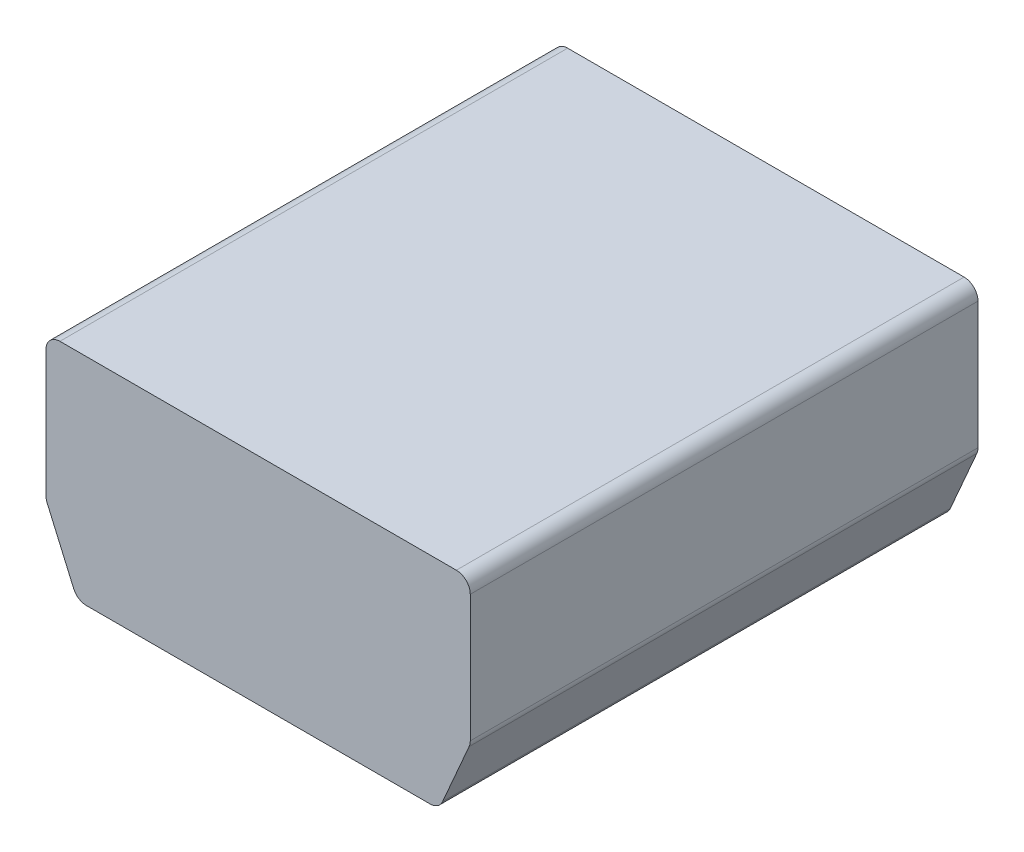
ISO-10303-21;
HEADER;
FILE_DESCRIPTION(('STEP AP214'),'2;1');
FILE_NAME('part.step','',(''),(''),'','','');
FILE_SCHEMA(('AUTOMOTIVE_DESIGN { 1 0 10303 214 1 1 1 1 }'));
ENDSEC;
DATA;
#1=APPLICATION_CONTEXT('core data for automotive mechanical design processes');
#2=APPLICATION_PROTOCOL_DEFINITION('international standard','automotive_design',2000,#1);
#3=PRODUCT_CONTEXT('',#1,'mechanical');
#4=PRODUCT('Part','Part','',(#3));
#5=PRODUCT_RELATED_PRODUCT_CATEGORY('part','',(#4));
#6=PRODUCT_DEFINITION_FORMATION('','',#4);
#7=PRODUCT_DEFINITION_CONTEXT('part definition',#1,'design');
#8=PRODUCT_DEFINITION('design','',#6,#7);
#9=PRODUCT_DEFINITION_SHAPE('','',#8);
#10=(LENGTH_UNIT() NAMED_UNIT(*) SI_UNIT(.MILLI.,.METRE.));
#11=(NAMED_UNIT(*) PLANE_ANGLE_UNIT() SI_UNIT($,.RADIAN.));
#12=(NAMED_UNIT(*) SI_UNIT($,.STERADIAN.) SOLID_ANGLE_UNIT());
#13=UNCERTAINTY_MEASURE_WITH_UNIT(LENGTH_MEASURE(1.E-05),#10,'distance_accuracy_value','');
#14=(GEOMETRIC_REPRESENTATION_CONTEXT(3) GLOBAL_UNCERTAINTY_ASSIGNED_CONTEXT((#13)) GLOBAL_UNIT_ASSIGNED_CONTEXT((#10,
#11,#12)) REPRESENTATION_CONTEXT('',''));
#15=CARTESIAN_POINT('',(0.,0.,0.));
#16=DIRECTION('',(0.,0.,1.));
#17=DIRECTION('',(1.,0.,0.));
#18=AXIS2_PLACEMENT_3D('',#15,#16,#17);
#19=CARTESIAN_POINT('',(-3.3684488384,0.1525862328,0.));
#20=DIRECTION('',(0.916834796588267,0.399266772678306,0.));
#21=DIRECTION('',(-0.399266772678306,0.916834796588267,0.));
#22=AXIS2_PLACEMENT_3D('',#19,#20,#21);
#23=PLANE('',#22);
#24=DIRECTION('',(-0.399266772678306,0.916834796588267,0.));
#25=VECTOR('',#24,1.);
#26=CARTESIAN_POINT('',(-3.6104124388,0.7082063433,0.));
#27=LINE('',#26,#25);
#28=CARTESIAN_POINT('',(-3.36844883946309,0.152586239705988,0.));
#29=VERTEX_POINT('',#28);
#30=CARTESIAN_POINT('',(-3.85237604026309,1.26382646070599,0.));
#31=VERTEX_POINT('',#30);
#32=EDGE_CURVE('E187',#29,#31,#27,.T.);
#33=ORIENTED_EDGE('',*,*,#32,.F.);
#34=DIRECTION('',(0.,0.,-1.));
#35=VECTOR('',#34,1.);
#36=CARTESIAN_POINT('',(-3.36844883812397,0.152586241095773,4.6355));
#37=LINE('',#36,#35);
#38=CARTESIAN_POINT('',(-3.36844883946309,0.152586239705988,9.271));
#39=VERTEX_POINT('',#38);
#40=EDGE_CURVE('E202',#29,#39,#37,.F.);
#41=ORIENTED_EDGE('',*,*,#40,.T.);
#42=DIRECTION('',(0.399266772678306,-0.916834796588267,0.));
#43=VECTOR('',#42,1.);
#44=CARTESIAN_POINT('',(-3.6104124388,0.7082063433,9.271));
#45=LINE('',#44,#43);
#46=CARTESIAN_POINT('',(-3.85237604026309,1.26382646070599,9.271));
#47=VERTEX_POINT('',#46);
#48=EDGE_CURVE('E204',#47,#39,#45,.T.);
#49=ORIENTED_EDGE('',*,*,#48,.F.);
#50=DIRECTION('',(0.,0.,1.));
#51=VECTOR('',#50,1.);
#52=CARTESIAN_POINT('',(-3.85237603892397,1.26382646209577,4.6355));
#53=LINE('',#52,#51);
#54=EDGE_CURVE('E284',#47,#31,#53,.F.);
#55=ORIENTED_EDGE('',*,*,#54,.T.);
#56=EDGE_LOOP('',(#33,#41,#49,#55));
#57=FACE_BOUND('',#56,.T.);
#58=ADVANCED_FACE('F16',(#57),#23,.F.);
#59=CARTESIAN_POINT('',(3.8523760392,1.2638264538,0.));
#60=DIRECTION('',(-0.916834796588267,0.399266772678306,0.));
#61=DIRECTION('',(-0.399266772678306,-0.916834796588267,0.));
#62=AXIS2_PLACEMENT_3D('',#59,#60,#61);
#63=PLANE('',#62);
#64=DIRECTION('',(-0.399266772678306,-0.916834796588267,0.));
#65=VECTOR('',#64,1.);
#66=CARTESIAN_POINT('',(3.6104124388,0.7082063433,0.));
#67=LINE('',#66,#65);
#68=CARTESIAN_POINT('',(3.8523760402514,1.26382646067913,0.));
#69=VERTEX_POINT('',#68);
#70=CARTESIAN_POINT('',(3.3684488394514,0.152586239679135,0.));
#71=VERTEX_POINT('',#70);
#72=EDGE_CURVE('E175',#69,#71,#67,.T.);
#73=ORIENTED_EDGE('',*,*,#72,.F.);
#74=DIRECTION('',(0.,0.,-1.));
#75=VECTOR('',#74,1.);
#76=CARTESIAN_POINT('',(3.85237603890058,1.26382646204207,4.6355));
#77=LINE('',#76,#75);
#78=CARTESIAN_POINT('',(3.8523760402514,1.26382646067913,9.271));
#79=VERTEX_POINT('',#78);
#80=EDGE_CURVE('E262',#69,#79,#77,.F.);
#81=ORIENTED_EDGE('',*,*,#80,.T.);
#82=DIRECTION('',(-0.399266772678306,-0.916834796588267,0.));
#83=VECTOR('',#82,1.);
#84=CARTESIAN_POINT('',(3.8523760392,1.2638264538,9.271));
#85=LINE('',#84,#83);
#86=CARTESIAN_POINT('',(3.3684488394514,0.152586239679135,9.271));
#87=VERTEX_POINT('',#86);
#88=EDGE_CURVE('E198',#79,#87,#85,.T.);
#89=ORIENTED_EDGE('',*,*,#88,.T.);
#90=DIRECTION('',(0.,0.,1.));
#91=VECTOR('',#90,1.);
#92=CARTESIAN_POINT('',(3.36844883810058,0.152586241042068,4.6355));
#93=LINE('',#92,#91);
#94=EDGE_CURVE('E186',#87,#71,#93,.F.);
#95=ORIENTED_EDGE('',*,*,#94,.T.);
#96=EDGE_LOOP('',(#73,#81,#89,#95));
#97=FACE_BOUND('',#96,.T.);
#98=ADVANCED_FACE('F197',(#97),#63,.F.);
#99=CARTESIAN_POINT('',(3.1355727992,0.254,9.271));
#100=DIRECTION('',(0.,0.,-1.));
#101=DIRECTION('',(-1.,0.,0.));
#102=AXIS2_PLACEMENT_3D('',#99,#100,#101);
#103=CYLINDRICAL_SURFACE('',#102,0.254);
#104=CARTESIAN_POINT('',(3.1355727992,0.254,0.));
#105=DIRECTION('',(0.,0.,-1.));
#106=DIRECTION('',(-1.,0.,0.));
#107=AXIS2_PLACEMENT_3D('',#104,#105,#106);
#108=CIRCLE('',#107,0.254);
#109=CARTESIAN_POINT('',(3.1355727992,0.,0.));
#110=VERTEX_POINT('',#109);
#111=EDGE_CURVE('E20',#71,#110,#108,.T.);
#112=ORIENTED_EDGE('',*,*,#111,.F.);
#113=ORIENTED_EDGE('',*,*,#94,.F.);
#114=CARTESIAN_POINT('',(3.1355727992,0.254,9.271));
#115=DIRECTION('',(0.,0.,-1.));
#116=DIRECTION('',(-1.,0.,0.));
#117=AXIS2_PLACEMENT_3D('',#114,#115,#116);
#118=CIRCLE('',#117,0.254);
#119=CARTESIAN_POINT('',(3.1355727992,0.,9.271));
#120=VERTEX_POINT('',#119);
#121=EDGE_CURVE('E278',#87,#120,#118,.T.);
#122=ORIENTED_EDGE('',*,*,#121,.T.);
#123=DIRECTION('',(0.,0.,-1.));
#124=VECTOR('',#123,1.);
#125=CARTESIAN_POINT('',(3.1355727992,0.,4.6355));
#126=LINE('',#125,#124);
#127=EDGE_CURVE('E193',#120,#110,#126,.T.);
#128=ORIENTED_EDGE('',*,*,#127,.T.);
#129=EDGE_LOOP('',(#112,#113,#122,#128));
#130=FACE_BOUND('',#129,.T.);
#131=ADVANCED_FACE('F190',(#130),#103,.T.);
#132=CARTESIAN_POINT('',(-3.1355727992,0.254,9.271));
#133=DIRECTION('',(0.,0.,-1.));
#134=DIRECTION('',(-1.,0.,0.));
#135=AXIS2_PLACEMENT_3D('',#132,#133,#134);
#136=CYLINDRICAL_SURFACE('',#135,0.254000000000001);
#137=CARTESIAN_POINT('',(-3.1355727992,0.254,0.));
#138=DIRECTION('',(0.,0.,-1.));
#139=DIRECTION('',(-1.,0.,0.));
#140=AXIS2_PLACEMENT_3D('',#137,#138,#139);
#141=CIRCLE('',#140,0.254000000000001);
#142=CARTESIAN_POINT('',(-3.1355727992,0.,0.));
#143=VERTEX_POINT('',#142);
#144=EDGE_CURVE('E195',#143,#29,#141,.T.);
#145=ORIENTED_EDGE('',*,*,#144,.F.);
#146=DIRECTION('',(0.,0.,1.));
#147=VECTOR('',#146,1.);
#148=CARTESIAN_POINT('',(-3.1355727992,0.,4.6355));
#149=LINE('',#148,#147);
#150=CARTESIAN_POINT('',(-3.1355727992,0.,9.271));
#151=VERTEX_POINT('',#150);
#152=EDGE_CURVE('E300',#143,#151,#149,.T.);
#153=ORIENTED_EDGE('',*,*,#152,.T.);
#154=CARTESIAN_POINT('',(-3.1355727992,0.254,9.271));
#155=DIRECTION('',(0.,0.,-1.));
#156=DIRECTION('',(-1.,0.,0.));
#157=AXIS2_PLACEMENT_3D('',#154,#155,#156);
#158=CIRCLE('',#157,0.254000000000001);
#159=EDGE_CURVE('E275',#151,#39,#158,.T.);
#160=ORIENTED_EDGE('',*,*,#159,.T.);
#161=ORIENTED_EDGE('',*,*,#40,.F.);
#162=EDGE_LOOP('',(#145,#153,#160,#161));
#163=FACE_BOUND('',#162,.T.);
#164=ADVANCED_FACE('F613',(#163),#136,.T.);
#165=CARTESIAN_POINT('',(-3.6195,1.365240221,9.271));
#166=DIRECTION('',(0.,0.,-1.));
#167=DIRECTION('',(-1.,0.,0.));
#168=AXIS2_PLACEMENT_3D('',#165,#166,#167);
#169=CYLINDRICAL_SURFACE('',#168,0.254);
#170=CARTESIAN_POINT('',(-3.6195,1.365240221,0.));
#171=DIRECTION('',(0.,0.,-1.));
#172=DIRECTION('',(-1.,0.,0.));
#173=AXIS2_PLACEMENT_3D('',#170,#171,#172);
#174=CIRCLE('',#173,0.254);
#175=CARTESIAN_POINT('',(-3.8735,1.365240221,0.));
#176=VERTEX_POINT('',#175);
#177=EDGE_CURVE('E283',#31,#176,#174,.T.);
#178=ORIENTED_EDGE('',*,*,#177,.F.);
#179=ORIENTED_EDGE('',*,*,#54,.F.);
#180=CARTESIAN_POINT('',(-3.6195,1.365240221,9.271));
#181=DIRECTION('',(0.,0.,-1.));
#182=DIRECTION('',(-1.,0.,0.));
#183=AXIS2_PLACEMENT_3D('',#180,#181,#182);
#184=CIRCLE('',#183,0.254);
#185=CARTESIAN_POINT('',(-3.8735,1.365240221,9.271));
#186=VERTEX_POINT('',#185);
#187=EDGE_CURVE('E273',#47,#186,#184,.T.);
#188=ORIENTED_EDGE('',*,*,#187,.T.);
#189=DIRECTION('',(0.,0.,-1.));
#190=VECTOR('',#189,1.);
#191=CARTESIAN_POINT('',(-3.8735,1.365240221,4.6355));
#192=LINE('',#191,#190);
#193=EDGE_CURVE('E299',#186,#176,#192,.T.);
#194=ORIENTED_EDGE('',*,*,#193,.T.);
#195=EDGE_LOOP('',(#178,#179,#188,#194));
#196=FACE_BOUND('',#195,.T.);
#197=ADVANCED_FACE('F604',(#196),#169,.T.);
#198=CARTESIAN_POINT('',(-3.6195,3.683,9.271));
#199=DIRECTION('',(0.,0.,-1.));
#200=DIRECTION('',(-1.,0.,0.));
#201=AXIS2_PLACEMENT_3D('',#198,#199,#200);
#202=CYLINDRICAL_SURFACE('',#201,0.254);
#203=CARTESIAN_POINT('',(-3.6195,3.683,0.));
#204=DIRECTION('',(0.,0.,-1.));
#205=DIRECTION('',(-1.,0.,0.));
#206=AXIS2_PLACEMENT_3D('',#203,#204,#205);
#207=CIRCLE('',#206,0.254);
#208=CARTESIAN_POINT('',(-3.8735,3.683,0.));
#209=VERTEX_POINT('',#208);
#210=CARTESIAN_POINT('',(-3.6195,3.937,0.));
#211=VERTEX_POINT('',#210);
#212=EDGE_CURVE('E281',#209,#211,#207,.T.);
#213=ORIENTED_EDGE('',*,*,#212,.F.);
#214=DIRECTION('',(0.,0.,1.));
#215=VECTOR('',#214,1.);
#216=CARTESIAN_POINT('',(-3.8735,3.683,4.6355));
#217=LINE('',#216,#215);
#218=CARTESIAN_POINT('',(-3.8735,3.683,9.271));
#219=VERTEX_POINT('',#218);
#220=EDGE_CURVE('E305',#209,#219,#217,.T.);
#221=ORIENTED_EDGE('',*,*,#220,.T.);
#222=CARTESIAN_POINT('',(-3.6195,3.683,9.271));
#223=DIRECTION('',(0.,0.,-1.));
#224=DIRECTION('',(-1.,0.,0.));
#225=AXIS2_PLACEMENT_3D('',#222,#223,#224);
#226=CIRCLE('',#225,0.254);
#227=CARTESIAN_POINT('',(-3.6195,3.937,9.271));
#228=VERTEX_POINT('',#227);
#229=EDGE_CURVE('E271',#219,#228,#226,.T.);
#230=ORIENTED_EDGE('',*,*,#229,.T.);
#231=DIRECTION('',(0.,0.,-1.));
#232=VECTOR('',#231,1.);
#233=CARTESIAN_POINT('',(-3.6195,3.937,4.6355));
#234=LINE('',#233,#232);
#235=EDGE_CURVE('E304',#228,#211,#234,.T.);
#236=ORIENTED_EDGE('',*,*,#235,.T.);
#237=EDGE_LOOP('',(#213,#221,#230,#236));
#238=FACE_BOUND('',#237,.T.);
#239=ADVANCED_FACE('F595',(#238),#202,.T.);
#240=CARTESIAN_POINT('',(3.8735,0.,9.271));
#241=DIRECTION('',(0.,0.,-1.));
#242=DIRECTION('',(-1.,0.,0.));
#243=AXIS2_PLACEMENT_3D('',#240,#241,#242);
#244=PLANE('',#243);
#245=DIRECTION('',(0.,1.,0.));
#246=VECTOR('',#245,1.);
#247=CARTESIAN_POINT('',(3.8735,2.5241201105,9.271));
#248=LINE('',#247,#246);
#249=CARTESIAN_POINT('',(3.8735,1.365240221,9.271));
#250=VERTEX_POINT('',#249);
#251=CARTESIAN_POINT('',(3.8735,3.683,9.271));
#252=VERTEX_POINT('',#251);
#253=EDGE_CURVE('E306',#250,#252,#248,.T.);
#254=ORIENTED_EDGE('',*,*,#253,.T.);
#255=CARTESIAN_POINT('',(3.6195,3.683,9.271));
#256=DIRECTION('',(0.,0.,-1.));
#257=DIRECTION('',(-1.,0.,0.));
#258=AXIS2_PLACEMENT_3D('',#255,#256,#257);
#259=CIRCLE('',#258,0.254);
#260=CARTESIAN_POINT('',(3.6195,3.937,9.271));
#261=VERTEX_POINT('',#260);
#262=EDGE_CURVE('E268',#252,#261,#259,.F.);
#263=ORIENTED_EDGE('',*,*,#262,.T.);
#264=DIRECTION('',(-1.,0.,0.));
#265=VECTOR('',#264,1.);
#266=CARTESIAN_POINT('',(0.,3.937,9.271));
#267=LINE('',#266,#265);
#268=EDGE_CURVE('E301',#261,#228,#267,.T.);
#269=ORIENTED_EDGE('',*,*,#268,.T.);
#270=ORIENTED_EDGE('',*,*,#229,.F.);
#271=DIRECTION('',(0.,-1.,0.));
#272=VECTOR('',#271,1.);
#273=CARTESIAN_POINT('',(-3.8735,2.5241201105,9.271));
#274=LINE('',#273,#272);
#275=EDGE_CURVE('E296',#219,#186,#274,.T.);
#276=ORIENTED_EDGE('',*,*,#275,.T.);
#277=ORIENTED_EDGE('',*,*,#187,.F.);
#278=ORIENTED_EDGE('',*,*,#48,.T.);
#279=ORIENTED_EDGE('',*,*,#159,.F.);
#280=DIRECTION('',(1.,0.,0.));
#281=VECTOR('',#280,1.);
#282=CARTESIAN_POINT('',(0.,0.,9.271));
#283=LINE('',#282,#281);
#284=EDGE_CURVE('E293',#151,#120,#283,.T.);
#285=ORIENTED_EDGE('',*,*,#284,.T.);
#286=ORIENTED_EDGE('',*,*,#121,.F.);
#287=ORIENTED_EDGE('',*,*,#88,.F.);
#288=CARTESIAN_POINT('',(3.6195,1.365240221,9.271));
#289=DIRECTION('',(0.,0.,-1.));
#290=DIRECTION('',(-1.,0.,0.));
#291=AXIS2_PLACEMENT_3D('',#288,#289,#290);
#292=CIRCLE('',#291,0.254);
#293=EDGE_CURVE('E263',#79,#250,#292,.F.);
#294=ORIENTED_EDGE('',*,*,#293,.T.);
#295=EDGE_LOOP('',(#254,#263,#269,#270,#276,#277,#278,#279,#285,#286,#287,#294));
#296=FACE_BOUND('',#295,.T.);
#297=ADVANCED_FACE('F586',(#296),#244,.F.);
#298=CARTESIAN_POINT('',(3.6195,3.683,9.271));
#299=DIRECTION('',(0.,0.,-1.));
#300=DIRECTION('',(-1.,0.,0.));
#301=AXIS2_PLACEMENT_3D('',#298,#299,#300);
#302=CYLINDRICAL_SURFACE('',#301,0.254);
#303=CARTESIAN_POINT('',(3.6195,3.683,0.));
#304=DIRECTION('',(0.,0.,-1.));
#305=DIRECTION('',(-1.,0.,0.));
#306=AXIS2_PLACEMENT_3D('',#303,#304,#305);
#307=CIRCLE('',#306,0.254);
#308=CARTESIAN_POINT('',(3.6195,3.937,0.));
#309=VERTEX_POINT('',#308);
#310=CARTESIAN_POINT('',(3.8735,3.683,0.));
#311=VERTEX_POINT('',#310);
#312=EDGE_CURVE('E266',#309,#311,#307,.T.);
#313=ORIENTED_EDGE('',*,*,#312,.F.);
#314=DIRECTION('',(0.,0.,1.));
#315=VECTOR('',#314,1.);
#316=CARTESIAN_POINT('',(3.6195,3.937,4.6355));
#317=LINE('',#316,#315);
#318=EDGE_CURVE('E310',#309,#261,#317,.T.);
#319=ORIENTED_EDGE('',*,*,#318,.T.);
#320=ORIENTED_EDGE('',*,*,#262,.F.);
#321=DIRECTION('',(0.,0.,-1.));
#322=VECTOR('',#321,1.);
#323=CARTESIAN_POINT('',(3.8735,3.683,4.6355));
#324=LINE('',#323,#322);
#325=EDGE_CURVE('E309',#252,#311,#324,.T.);
#326=ORIENTED_EDGE('',*,*,#325,.T.);
#327=EDGE_LOOP('',(#313,#319,#320,#326));
#328=FACE_BOUND('',#327,.T.);
#329=ADVANCED_FACE('F577',(#328),#302,.T.);
#330=CARTESIAN_POINT('',(3.6195,1.365240221,9.271));
#331=DIRECTION('',(0.,0.,-1.));
#332=DIRECTION('',(-1.,0.,0.));
#333=AXIS2_PLACEMENT_3D('',#330,#331,#332);
#334=CYLINDRICAL_SURFACE('',#333,0.254);
#335=CARTESIAN_POINT('',(3.6195,1.365240221,0.));
#336=DIRECTION('',(0.,0.,-1.));
#337=DIRECTION('',(-1.,0.,0.));
#338=AXIS2_PLACEMENT_3D('',#335,#336,#337);
#339=CIRCLE('',#338,0.254);
#340=CARTESIAN_POINT('',(3.8735,1.365240221,0.));
#341=VERTEX_POINT('',#340);
#342=EDGE_CURVE('E181',#341,#69,#339,.T.);
#343=ORIENTED_EDGE('',*,*,#342,.F.);
#344=DIRECTION('',(0.,0.,1.));
#345=VECTOR('',#344,1.);
#346=CARTESIAN_POINT('',(3.8735,1.365240221,4.6355));
#347=LINE('',#346,#345);
#348=EDGE_CURVE('E322',#341,#250,#347,.T.);
#349=ORIENTED_EDGE('',*,*,#348,.T.);
#350=ORIENTED_EDGE('',*,*,#293,.F.);
#351=ORIENTED_EDGE('',*,*,#80,.F.);
#352=EDGE_LOOP('',(#343,#349,#350,#351));
#353=FACE_BOUND('',#352,.T.);
#354=ADVANCED_FACE('F568',(#353),#334,.T.);
#355=CARTESIAN_POINT('',(-3.1355727992,0.,0.));
#356=DIRECTION('',(0.,1.,0.));
#357=DIRECTION('',(0.,0.,1.));
#358=AXIS2_PLACEMENT_3D('',#355,#356,#357);
#359=PLANE('',#358);
#360=DIRECTION('',(-1.,0.,0.));
#361=VECTOR('',#360,1.);
#362=CARTESIAN_POINT('',(0.,0.,0.));
#363=LINE('',#362,#361);
#364=EDGE_CURVE('E331',#110,#143,#363,.T.);
#365=ORIENTED_EDGE('',*,*,#364,.F.);
#366=ORIENTED_EDGE('',*,*,#127,.F.);
#367=ORIENTED_EDGE('',*,*,#284,.F.);
#368=ORIENTED_EDGE('',*,*,#152,.F.);
#369=EDGE_LOOP('',(#365,#366,#367,#368));
#370=FACE_BOUND('',#369,.T.);
#371=ADVANCED_FACE('F559',(#370),#359,.F.);
#372=CARTESIAN_POINT('',(-3.8735,1.365240221,0.));
#373=DIRECTION('',(1.,0.,0.));
#374=DIRECTION('',(0.,1.,0.));
#375=AXIS2_PLACEMENT_3D('',#372,#373,#374);
#376=PLANE('',#375);
#377=DIRECTION('',(0.,1.,0.));
#378=VECTOR('',#377,1.);
#379=CARTESIAN_POINT('',(-3.8735,1.9685,0.));
#380=LINE('',#379,#378);
#381=EDGE_CURVE('E333',#176,#209,#380,.T.);
#382=ORIENTED_EDGE('',*,*,#381,.F.);
#383=ORIENTED_EDGE('',*,*,#193,.F.);
#384=ORIENTED_EDGE('',*,*,#275,.F.);
#385=ORIENTED_EDGE('',*,*,#220,.F.);
#386=EDGE_LOOP('',(#382,#383,#384,#385));
#387=FACE_BOUND('',#386,.T.);
#388=ADVANCED_FACE('F550',(#387),#376,.F.);
#389=CARTESIAN_POINT('',(-3.6195,3.937,9.271));
#390=DIRECTION('',(0.,-1.,0.));
#391=DIRECTION('',(0.,0.,-1.));
#392=AXIS2_PLACEMENT_3D('',#389,#390,#391);
#393=PLANE('',#392);
#394=DIRECTION('',(1.,0.,0.));
#395=VECTOR('',#394,1.);
#396=CARTESIAN_POINT('',(0.,3.937,0.));
#397=LINE('',#396,#395);
#398=EDGE_CURVE('E336',#211,#309,#397,.T.);
#399=ORIENTED_EDGE('',*,*,#398,.F.);
#400=ORIENTED_EDGE('',*,*,#235,.F.);
#401=ORIENTED_EDGE('',*,*,#268,.F.);
#402=ORIENTED_EDGE('',*,*,#318,.F.);
#403=EDGE_LOOP('',(#399,#400,#401,#402));
#404=FACE_BOUND('',#403,.T.);
#405=ADVANCED_FACE('F542',(#404),#393,.F.);
#406=CARTESIAN_POINT('',(3.8735,3.683,0.));
#407=DIRECTION('',(-1.,0.,0.));
#408=DIRECTION('',(0.,-1.,0.));
#409=AXIS2_PLACEMENT_3D('',#406,#407,#408);
#410=PLANE('',#409);
#411=DIRECTION('',(0.,-1.,0.));
#412=VECTOR('',#411,1.);
#413=CARTESIAN_POINT('',(3.8735,1.9685,0.));
#414=LINE('',#413,#412);
#415=EDGE_CURVE('E260',#311,#341,#414,.T.);
#416=ORIENTED_EDGE('',*,*,#415,.F.);
#417=ORIENTED_EDGE('',*,*,#325,.F.);
#418=ORIENTED_EDGE('',*,*,#253,.F.);
#419=ORIENTED_EDGE('',*,*,#348,.F.);
#420=EDGE_LOOP('',(#416,#417,#418,#419));
#421=FACE_BOUND('',#420,.T.);
#422=ADVANCED_FACE('F452',(#421),#410,.F.);
#423=CARTESIAN_POINT('',(3.4925,1.3916936606,0.));
#424=DIRECTION('',(-0.916834802884332,0.399266758220676,0.));
#425=DIRECTION('',(-0.399266758220676,-0.916834802884332,0.));
#426=AXIS2_PLACEMENT_3D('',#423,#424,#425);
#427=PLANE('',#426);
#428=DIRECTION('',(0.,0.,1.));
#429=VECTOR('',#428,1.);
#430=CARTESIAN_POINT('',(3.4925,1.3916936606,4.445));
#431=LINE('',#430,#429);
#432=CARTESIAN_POINT('',(3.4925,1.39169366221102,0.));
#433=VERTEX_POINT('',#432);
#434=CARTESIAN_POINT('',(3.4925,1.3916936606,8.89));
#435=VERTEX_POINT('',#434);
#436=EDGE_CURVE('E213',#433,#435,#431,.T.);
#437=ORIENTED_EDGE('',*,*,#436,.F.);
#438=DIRECTION('',(0.399266765488405,0.916834799719353,0.));
#439=VECTOR('',#438,1.);
#440=CARTESIAN_POINT('',(3.05235921404,0.381000001778,0.));
#441=LINE('',#440,#439);
#442=CARTESIAN_POINT('',(3.05235921873286,0.381,0.));
#443=VERTEX_POINT('',#442);
#444=EDGE_CURVE('E255',#443,#433,#441,.T.);
#445=ORIENTED_EDGE('',*,*,#444,.F.);
#446=DIRECTION('',(0.,0.,-1.));
#447=VECTOR('',#446,1.);
#448=CARTESIAN_POINT('',(3.0523592242,0.381,4.445));
#449=LINE('',#448,#447);
#450=CARTESIAN_POINT('',(3.0523592207075,0.381,8.89));
#451=VERTEX_POINT('',#450);
#452=EDGE_CURVE('E207',#451,#443,#449,.T.);
#453=ORIENTED_EDGE('',*,*,#452,.F.);
#454=DIRECTION('',(0.399266758220676,0.916834802884332,0.));
#455=VECTOR('',#454,1.);
#456=CARTESIAN_POINT('',(3.2724296121,0.8863468303,8.89));
#457=LINE('',#456,#455);
#458=EDGE_CURVE('E325',#451,#435,#457,.T.);
#459=ORIENTED_EDGE('',*,*,#458,.T.);
#460=EDGE_LOOP('',(#437,#445,#453,#459));
#461=FACE_BOUND('',#460,.T.);
#462=ADVANCED_FACE('F435',(#461),#427,.T.);
#463=CARTESIAN_POINT('',(-3.0523592242,0.381,0.));
#464=DIRECTION('',(0.916834802884332,0.399266758220676,0.));
#465=DIRECTION('',(-0.399266758220676,0.916834802884332,0.));
#466=AXIS2_PLACEMENT_3D('',#463,#464,#465);
#467=PLANE('',#466);
#468=DIRECTION('',(0.,0.,1.));
#469=VECTOR('',#468,1.);
#470=CARTESIAN_POINT('',(-3.0523592242,0.381,4.445));
#471=LINE('',#470,#469);
#472=CARTESIAN_POINT('',(-3.05235921873286,0.381,0.));
#473=VERTEX_POINT('',#472);
#474=CARTESIAN_POINT('',(-3.0523592207075,0.381,8.89));
#475=VERTEX_POINT('',#474);
#476=EDGE_CURVE('E210',#473,#475,#471,.T.);
#477=ORIENTED_EDGE('',*,*,#476,.F.);
#478=DIRECTION('',(0.399266765488405,-0.916834799719353,0.));
#479=VECTOR('',#478,1.);
#480=CARTESIAN_POINT('',(-3.492499998984,1.391693661489,0.));
#481=LINE('',#480,#479);
#482=CARTESIAN_POINT('',(-3.4925,1.39169366221102,0.));
#483=VERTEX_POINT('',#482);
#484=EDGE_CURVE('E258',#483,#473,#481,.T.);
#485=ORIENTED_EDGE('',*,*,#484,.F.);
#486=DIRECTION('',(0.,0.,-1.));
#487=VECTOR('',#486,1.);
#488=CARTESIAN_POINT('',(-3.4925,1.3916936606,4.445));
#489=LINE('',#488,#487);
#490=CARTESIAN_POINT('',(-3.4925,1.3916936606,8.89));
#491=VERTEX_POINT('',#490);
#492=EDGE_CURVE('E220',#491,#483,#489,.T.);
#493=ORIENTED_EDGE('',*,*,#492,.F.);
#494=DIRECTION('',(0.399266758220676,-0.916834802884332,0.));
#495=VECTOR('',#494,1.);
#496=CARTESIAN_POINT('',(-3.2724296121,0.8863468303,8.89));
#497=LINE('',#496,#495);
#498=EDGE_CURVE('E329',#491,#475,#497,.T.);
#499=ORIENTED_EDGE('',*,*,#498,.T.);
#500=EDGE_LOOP('',(#477,#485,#493,#499));
#501=FACE_BOUND('',#500,.T.);
#502=ADVANCED_FACE('F441',(#501),#467,.T.);
#503=CARTESIAN_POINT('',(3.8735,0.,0.));
#504=DIRECTION('',(0.,0.,-1.));
#505=DIRECTION('',(-1.,0.,0.));
#506=AXIS2_PLACEMENT_3D('',#503,#504,#505);
#507=PLANE('',#506);
#508=ORIENTED_EDGE('',*,*,#444,.T.);
#509=DIRECTION('',(0.,-1.,0.));
#510=VECTOR('',#509,1.);
#511=CARTESIAN_POINT('',(3.4925,2.4738468303,0.));
#512=LINE('',#511,#510);
#513=CARTESIAN_POINT('',(3.492499999746,3.5559999995555,0.));
#514=VERTEX_POINT('',#513);
#515=EDGE_CURVE('E214',#514,#433,#512,.T.);
#516=ORIENTED_EDGE('',*,*,#515,.F.);
#517=DIRECTION('',(1.,0.,0.));
#518=VECTOR('',#517,1.);
#519=CARTESIAN_POINT('',(0.,3.556,0.));
#520=LINE('',#519,#518);
#521=CARTESIAN_POINT('',(-3.492499999746,3.5559999995555,0.));
#522=VERTEX_POINT('',#521);
#523=EDGE_CURVE('E346',#522,#514,#520,.T.);
#524=ORIENTED_EDGE('',*,*,#523,.F.);
#525=DIRECTION('',(0.,1.,0.));
#526=VECTOR('',#525,1.);
#527=CARTESIAN_POINT('',(-3.4925,2.4738468303,0.));
#528=LINE('',#527,#526);
#529=EDGE_CURVE('E222',#483,#522,#528,.T.);
#530=ORIENTED_EDGE('',*,*,#529,.F.);
#531=ORIENTED_EDGE('',*,*,#484,.T.);
#532=DIRECTION('',(-1.,0.,0.));
#533=VECTOR('',#532,1.);
#534=CARTESIAN_POINT('',(0.,0.381,0.));
#535=LINE('',#534,#533);
#536=EDGE_CURVE('E209',#443,#473,#535,.T.);
#537=ORIENTED_EDGE('',*,*,#536,.F.);
#538=EDGE_LOOP('',(#508,#516,#524,#530,#531,#537));
#539=FACE_BOUND('',#538,.T.);
#540=ORIENTED_EDGE('',*,*,#312,.T.);
#541=ORIENTED_EDGE('',*,*,#415,.T.);
#542=ORIENTED_EDGE('',*,*,#342,.T.);
#543=ORIENTED_EDGE('',*,*,#72,.T.);
#544=ORIENTED_EDGE('',*,*,#111,.T.);
#545=ORIENTED_EDGE('',*,*,#364,.T.);
#546=ORIENTED_EDGE('',*,*,#144,.T.);
#547=ORIENTED_EDGE('',*,*,#32,.T.);
#548=ORIENTED_EDGE('',*,*,#177,.T.);
#549=ORIENTED_EDGE('',*,*,#381,.T.);
#550=ORIENTED_EDGE('',*,*,#212,.T.);
#551=ORIENTED_EDGE('',*,*,#398,.T.);
#552=EDGE_LOOP('',(#540,#541,#542,#543,#544,#545,#546,#547,#548,#549,#550,#551));
#553=FACE_BOUND('',#552,.T.);
#554=ADVANCED_FACE('F177',(#539,#553),#507,.T.);
#555=CARTESIAN_POINT('',(-1.7144998984,1.016,0.889));
#556=DIRECTION('',(0.707106781186547,0.707106781186548,0.));
#557=DIRECTION('',(-0.707106781186548,0.707106781186547,0.));
#558=AXIS2_PLACEMENT_3D('',#555,#556,#557);
#559=PLANE('',#558);
#560=DIRECTION('',(0.,0.,1.));
#561=VECTOR('',#560,1.);
#562=CARTESIAN_POINT('',(-1.7144998984,1.016,4.8895));
#563=LINE('',#562,#561);
#564=CARTESIAN_POINT('',(-1.7144998987175,1.016,0.889));
#565=VERTEX_POINT('',#564);
#566=CARTESIAN_POINT('',(-1.71449989855875,1.016,8.89));
#567=VERTEX_POINT('',#566);
#568=EDGE_CURVE('E226',#565,#567,#563,.T.);
#569=ORIENTED_EDGE('',*,*,#568,.T.);
#570=DIRECTION('',(0.707106781186548,-0.707106781186547,0.));
#571=VECTOR('',#570,1.);
#572=CARTESIAN_POINT('',(-1.9684999492,1.2700000508,8.89));
#573=LINE('',#572,#571);
#574=CARTESIAN_POINT('',(-2.222499999365,1.5240001016,8.89));
#575=VERTEX_POINT('',#574);
#576=EDGE_CURVE('E257',#575,#567,#573,.T.);
#577=ORIENTED_EDGE('',*,*,#576,.F.);
#578=DIRECTION('',(0.,0.,-1.));
#579=VECTOR('',#578,1.);
#580=CARTESIAN_POINT('',(-2.2225,1.5240001016,4.8895));
#581=LINE('',#580,#579);
#582=CARTESIAN_POINT('',(-2.2225,1.5240001016,0.889));
#583=VERTEX_POINT('',#582);
#584=EDGE_CURVE('E237',#575,#583,#581,.T.);
#585=ORIENTED_EDGE('',*,*,#584,.T.);
#586=DIRECTION('',(-0.707106780744605,0.70710678162849,0.));
#587=VECTOR('',#586,1.);
#588=CARTESIAN_POINT('',(-1.714499899035,1.016,0.889));
#589=LINE('',#588,#587);
#590=EDGE_CURVE('E243',#565,#583,#589,.T.);
#591=ORIENTED_EDGE('',*,*,#590,.F.);
#592=EDGE_LOOP('',(#569,#577,#585,#591));
#593=FACE_BOUND('',#592,.T.);
#594=ADVANCED_FACE('F379',(#593),#559,.F.);
#595=CARTESIAN_POINT('',(2.2225,1.5240001016,0.889));
#596=DIRECTION('',(-0.707106781186547,0.707106781186548,0.));
#597=DIRECTION('',(-0.707106781186548,-0.707106781186547,0.));
#598=AXIS2_PLACEMENT_3D('',#595,#596,#597);
#599=PLANE('',#598);
#600=DIRECTION('',(0.,0.,1.));
#601=VECTOR('',#600,1.);
#602=CARTESIAN_POINT('',(2.2225,1.5240001016,4.8895));
#603=LINE('',#602,#601);
#604=CARTESIAN_POINT('',(2.2225,1.5240001016,0.889));
#605=VERTEX_POINT('',#604);
#606=CARTESIAN_POINT('',(2.2224999996825,1.5240001016,8.89));
#607=VERTEX_POINT('',#606);
#608=EDGE_CURVE('E244',#605,#607,#603,.T.);
#609=ORIENTED_EDGE('',*,*,#608,.T.);
#610=DIRECTION('',(0.707106781186548,0.707106781186547,0.));
#611=VECTOR('',#610,1.);
#612=CARTESIAN_POINT('',(1.9684999492,1.2700000508,8.89));
#613=LINE('',#612,#611);
#614=CARTESIAN_POINT('',(1.71449989855875,1.016,8.89));
#615=VERTEX_POINT('',#614);
#616=EDGE_CURVE('E247',#615,#607,#613,.T.);
#617=ORIENTED_EDGE('',*,*,#616,.F.);
#618=DIRECTION('',(0.,0.,-1.));
#619=VECTOR('',#618,1.);
#620=CARTESIAN_POINT('',(1.7144998984,1.016,4.8895));
#621=LINE('',#620,#619);
#622=CARTESIAN_POINT('',(1.7144998987175,1.016,0.889));
#623=VERTEX_POINT('',#622);
#624=EDGE_CURVE('E232',#615,#623,#621,.T.);
#625=ORIENTED_EDGE('',*,*,#624,.T.);
#626=DIRECTION('',(-0.707106780744606,-0.707106781628489,0.));
#627=VECTOR('',#626,1.);
#628=CARTESIAN_POINT('',(2.2225,1.5240001016,0.889));
#629=LINE('',#628,#627);
#630=EDGE_CURVE('E250',#605,#623,#629,.T.);
#631=ORIENTED_EDGE('',*,*,#630,.F.);
#632=EDGE_LOOP('',(#609,#617,#625,#631));
#633=FACE_BOUND('',#632,.T.);
#634=ADVANCED_FACE('F385',(#633),#599,.F.);
#635=CARTESIAN_POINT('',(2.2225,1.5240001016,0.889));
#636=DIRECTION('',(-1.,0.,0.));
#637=DIRECTION('',(0.,0.,1.));
#638=AXIS2_PLACEMENT_3D('',#635,#636,#637);
#639=PLANE('',#638);
#640=DIRECTION('',(0.,0.,1.));
#641=VECTOR('',#640,1.);
#642=CARTESIAN_POINT('',(2.2225,2.54,4.8895));
#643=LINE('',#642,#641);
#644=CARTESIAN_POINT('',(2.2225,2.54,0.889));
#645=VERTEX_POINT('',#644);
#646=CARTESIAN_POINT('',(2.2224999996825,2.54,8.89));
#647=VERTEX_POINT('',#646);
#648=EDGE_CURVE('E236',#645,#647,#643,.T.);
#649=ORIENTED_EDGE('',*,*,#648,.T.);
#650=DIRECTION('',(0.,1.,0.));
#651=VECTOR('',#650,1.);
#652=CARTESIAN_POINT('',(2.2225,2.0320000508,8.89));
#653=LINE('',#652,#651);
#654=EDGE_CURVE('E35',#607,#647,#653,.T.);
#655=ORIENTED_EDGE('',*,*,#654,.F.);
#656=ORIENTED_EDGE('',*,*,#608,.F.);
#657=DIRECTION('',(0.,-1.,0.));
#658=VECTOR('',#657,1.);
#659=CARTESIAN_POINT('',(2.2225,1.778,0.889));
#660=LINE('',#659,#658);
#661=EDGE_CURVE('E240',#645,#605,#660,.T.);
#662=ORIENTED_EDGE('',*,*,#661,.F.);
#663=EDGE_LOOP('',(#649,#655,#656,#662));
#664=FACE_BOUND('',#663,.T.);
#665=ADVANCED_FACE('F388',(#664),#639,.F.);
#666=CARTESIAN_POINT('',(-2.2225,1.5240001016,8.89));
#667=DIRECTION('',(1.,0.,0.));
#668=DIRECTION('',(0.,0.,-1.));
#669=AXIS2_PLACEMENT_3D('',#666,#667,#668);
#670=PLANE('',#669);
#671=ORIENTED_EDGE('',*,*,#584,.F.);
#672=DIRECTION('',(0.,-1.,0.));
#673=VECTOR('',#672,1.);
#674=CARTESIAN_POINT('',(-2.2225,2.0320000508,8.89));
#675=LINE('',#674,#673);
#676=CARTESIAN_POINT('',(-2.2224999996825,2.54,8.89));
#677=VERTEX_POINT('',#676);
#678=EDGE_CURVE('E241',#677,#575,#675,.T.);
#679=ORIENTED_EDGE('',*,*,#678,.F.);
#680=DIRECTION('',(0.,0.,-1.));
#681=VECTOR('',#680,1.);
#682=CARTESIAN_POINT('',(-2.2225,2.54,4.8895));
#683=LINE('',#682,#681);
#684=CARTESIAN_POINT('',(-2.2225,2.54,0.889));
#685=VERTEX_POINT('',#684);
#686=EDGE_CURVE('E351',#677,#685,#683,.T.);
#687=ORIENTED_EDGE('',*,*,#686,.T.);
#688=DIRECTION('',(0.,1.,0.));
#689=VECTOR('',#688,1.);
#690=CARTESIAN_POINT('',(-2.2225,1.778,0.889));
#691=LINE('',#690,#689);
#692=EDGE_CURVE('E229',#583,#685,#691,.T.);
#693=ORIENTED_EDGE('',*,*,#692,.F.);
#694=EDGE_LOOP('',(#671,#679,#687,#693));
#695=FACE_BOUND('',#694,.T.);
#696=ADVANCED_FACE('F394',(#695),#670,.F.);
#697=CARTESIAN_POINT('',(2.2225,1.016,0.889));
#698=DIRECTION('',(0.,0.,-1.));
#699=DIRECTION('',(-1.,0.,0.));
#700=AXIS2_PLACEMENT_3D('',#697,#698,#699);
#701=PLANE('',#700);
#702=ORIENTED_EDGE('',*,*,#590,.T.);
#703=ORIENTED_EDGE('',*,*,#692,.T.);
#704=DIRECTION('',(1.,0.,0.));
#705=VECTOR('',#704,1.);
#706=CARTESIAN_POINT('',(0.,2.54,0.889));
#707=LINE('',#706,#705);
#708=EDGE_CURVE('E354',#685,#645,#707,.T.);
#709=ORIENTED_EDGE('',*,*,#708,.T.);
#710=ORIENTED_EDGE('',*,*,#661,.T.);
#711=ORIENTED_EDGE('',*,*,#630,.T.);
#712=DIRECTION('',(-1.,0.,0.));
#713=VECTOR('',#712,1.);
#714=CARTESIAN_POINT('',(0.,1.016,0.889));
#715=LINE('',#714,#713);
#716=EDGE_CURVE('E233',#623,#565,#715,.T.);
#717=ORIENTED_EDGE('',*,*,#716,.T.);
#718=EDGE_LOOP('',(#702,#703,#709,#710,#711,#717));
#719=FACE_BOUND('',#718,.T.);
#720=ADVANCED_FACE('F382',(#719),#701,.T.);
#721=CARTESIAN_POINT('',(-3.0523592242,0.381,0.));
#722=DIRECTION('',(0.,1.,0.));
#723=DIRECTION('',(0.,0.,1.));
#724=AXIS2_PLACEMENT_3D('',#721,#722,#723);
#725=PLANE('',#724);
#726=ORIENTED_EDGE('',*,*,#452,.T.);
#727=ORIENTED_EDGE('',*,*,#536,.T.);
#728=ORIENTED_EDGE('',*,*,#476,.T.);
#729=DIRECTION('',(1.,0.,0.));
#730=VECTOR('',#729,1.);
#731=CARTESIAN_POINT('',(0.,0.381,8.89));
#732=LINE('',#731,#730);
#733=EDGE_CURVE('E357',#475,#451,#732,.T.);
#734=ORIENTED_EDGE('',*,*,#733,.T.);
#735=EDGE_LOOP('',(#726,#727,#728,#734));
#736=FACE_BOUND('',#735,.T.);
#737=ADVANCED_FACE('F401',(#736),#725,.T.);
#738=CARTESIAN_POINT('',(3.4925,1.3916936606,0.));
#739=DIRECTION('',(-1.,0.,0.));
#740=DIRECTION('',(0.,0.,1.));
#741=AXIS2_PLACEMENT_3D('',#738,#739,#740);
#742=PLANE('',#741);
#743=DIRECTION('',(0.,0.,1.));
#744=VECTOR('',#743,1.);
#745=CARTESIAN_POINT('',(3.4925,3.556,4.445));
#746=LINE('',#745,#744);
#747=CARTESIAN_POINT('',(3.4925,3.556,8.89));
#748=VERTEX_POINT('',#747);
#749=EDGE_CURVE('E217',#514,#748,#746,.T.);
#750=ORIENTED_EDGE('',*,*,#749,.F.);
#751=ORIENTED_EDGE('',*,*,#515,.T.);
#752=ORIENTED_EDGE('',*,*,#436,.T.);
#753=DIRECTION('',(0.,1.,0.));
#754=VECTOR('',#753,1.);
#755=CARTESIAN_POINT('',(3.4925,1.9685,8.89));
#756=LINE('',#755,#754);
#757=EDGE_CURVE('E360',#435,#748,#756,.T.);
#758=ORIENTED_EDGE('',*,*,#757,.T.);
#759=EDGE_LOOP('',(#750,#751,#752,#758));
#760=FACE_BOUND('',#759,.T.);
#761=ADVANCED_FACE('F419',(#760),#742,.T.);
#762=CARTESIAN_POINT('',(-3.4925,3.556,8.89));
#763=DIRECTION('',(0.,-1.,0.));
#764=DIRECTION('',(0.,0.,-1.));
#765=AXIS2_PLACEMENT_3D('',#762,#763,#764);
#766=PLANE('',#765);
#767=DIRECTION('',(0.,0.,1.));
#768=VECTOR('',#767,1.);
#769=CARTESIAN_POINT('',(-3.4925,3.556,4.445));
#770=LINE('',#769,#768);
#771=CARTESIAN_POINT('',(-3.4925,3.556,8.89));
#772=VERTEX_POINT('',#771);
#773=EDGE_CURVE('E223',#522,#772,#770,.T.);
#774=ORIENTED_EDGE('',*,*,#773,.F.);
#775=ORIENTED_EDGE('',*,*,#523,.T.);
#776=ORIENTED_EDGE('',*,*,#749,.T.);
#777=DIRECTION('',(-1.,0.,0.));
#778=VECTOR('',#777,1.);
#779=CARTESIAN_POINT('',(0.,3.556,8.89));
#780=LINE('',#779,#778);
#781=EDGE_CURVE('E363',#748,#772,#780,.T.);
#782=ORIENTED_EDGE('',*,*,#781,.T.);
#783=EDGE_LOOP('',(#774,#775,#776,#782));
#784=FACE_BOUND('',#783,.T.);
#785=ADVANCED_FACE('F415',(#784),#766,.T.);
#786=CARTESIAN_POINT('',(-3.4925,1.3916936606,8.89));
#787=DIRECTION('',(1.,0.,0.));
#788=DIRECTION('',(0.,0.,-1.));
#789=AXIS2_PLACEMENT_3D('',#786,#787,#788);
#790=PLANE('',#789);
#791=ORIENTED_EDGE('',*,*,#492,.T.);
#792=ORIENTED_EDGE('',*,*,#529,.T.);
#793=ORIENTED_EDGE('',*,*,#773,.T.);
#794=DIRECTION('',(0.,-1.,0.));
#795=VECTOR('',#794,1.);
#796=CARTESIAN_POINT('',(-3.4925,1.9685,8.89));
#797=LINE('',#796,#795);
#798=EDGE_CURVE('E366',#772,#491,#797,.T.);
#799=ORIENTED_EDGE('',*,*,#798,.T.);
#800=EDGE_LOOP('',(#791,#792,#793,#799));
#801=FACE_BOUND('',#800,.T.);
#802=ADVANCED_FACE('F411',(#801),#790,.T.);
#803=CARTESIAN_POINT('',(-1.7144998984,1.016,0.889));
#804=DIRECTION('',(0.,1.,0.));
#805=DIRECTION('',(0.,0.,1.));
#806=AXIS2_PLACEMENT_3D('',#803,#804,#805);
#807=PLANE('',#806);
#808=ORIENTED_EDGE('',*,*,#624,.F.);
#809=DIRECTION('',(-1.,0.,0.));
#810=VECTOR('',#809,1.);
#811=CARTESIAN_POINT('',(0.,1.016,8.89));
#812=LINE('',#811,#810);
#813=EDGE_CURVE('E26',#615,#567,#812,.T.);
#814=ORIENTED_EDGE('',*,*,#813,.T.);
#815=ORIENTED_EDGE('',*,*,#568,.F.);
#816=ORIENTED_EDGE('',*,*,#716,.F.);
#817=EDGE_LOOP('',(#808,#814,#815,#816));
#818=FACE_BOUND('',#817,.T.);
#819=ADVANCED_FACE('F373',(#818),#807,.F.);
#820=CARTESIAN_POINT('',(-2.2225,2.54,8.89));
#821=DIRECTION('',(0.,-1.,0.));
#822=DIRECTION('',(0.,0.,-1.));
#823=AXIS2_PLACEMENT_3D('',#820,#821,#822);
#824=PLANE('',#823);
#825=ORIENTED_EDGE('',*,*,#686,.F.);
#826=DIRECTION('',(1.,0.,0.));
#827=VECTOR('',#826,1.);
#828=CARTESIAN_POINT('',(0.,2.54,8.89));
#829=LINE('',#828,#827);
#830=EDGE_CURVE('E11',#677,#647,#829,.T.);
#831=ORIENTED_EDGE('',*,*,#830,.T.);
#832=ORIENTED_EDGE('',*,*,#648,.F.);
#833=ORIENTED_EDGE('',*,*,#708,.F.);
#834=EDGE_LOOP('',(#825,#831,#832,#833));
#835=FACE_BOUND('',#834,.T.);
#836=ADVANCED_FACE('F392',(#835),#824,.F.);
#837=CARTESIAN_POINT('',(-3.4925,0.381,8.89));
#838=DIRECTION('',(0.,0.,1.));
#839=DIRECTION('',(1.,0.,0.));
#840=AXIS2_PLACEMENT_3D('',#837,#838,#839);
#841=PLANE('',#840);
#842=ORIENTED_EDGE('',*,*,#830,.F.);
#843=ORIENTED_EDGE('',*,*,#678,.T.);
#844=ORIENTED_EDGE('',*,*,#576,.T.);
#845=ORIENTED_EDGE('',*,*,#813,.F.);
#846=ORIENTED_EDGE('',*,*,#616,.T.);
#847=ORIENTED_EDGE('',*,*,#654,.T.);
#848=EDGE_LOOP('',(#842,#843,#844,#845,#846,#847));
#849=FACE_BOUND('',#848,.T.);
#850=ORIENTED_EDGE('',*,*,#781,.F.);
#851=ORIENTED_EDGE('',*,*,#757,.F.);
#852=ORIENTED_EDGE('',*,*,#458,.F.);
#853=ORIENTED_EDGE('',*,*,#733,.F.);
#854=ORIENTED_EDGE('',*,*,#498,.F.);
#855=ORIENTED_EDGE('',*,*,#798,.F.);
#856=EDGE_LOOP('',(#850,#851,#852,#853,#854,#855));
#857=FACE_BOUND('',#856,.T.);
#858=ADVANCED_FACE('F18',(#849,#857),#841,.F.);
#859=CLOSED_SHELL('',(#58,#98,#131,#164,#197,#239,#297,#329,#354,#371,#388,#405,#422,#462,#502,
#554,#594,#634,#665,#696,#720,#737,#761,#785,#802,#819,#836,#858));
#860=MANIFOLD_SOLID_BREP('B1',#859);
#861=ADVANCED_BREP_SHAPE_REPRESENTATION('',(#18,#860),#14);
#862=SHAPE_DEFINITION_REPRESENTATION(#9,#861);
ENDSEC;
END-ISO-10303-21;
